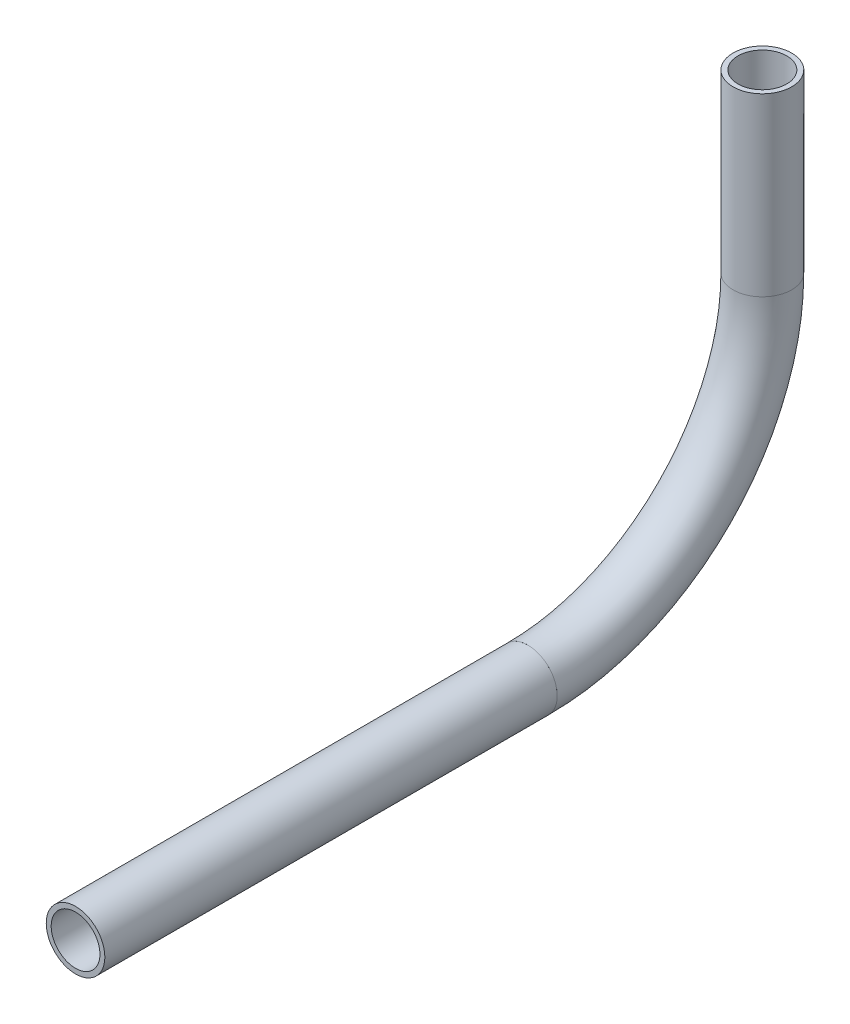
ISO-10303-21;
HEADER;
FILE_DESCRIPTION(('STEP AP214'),'2;1');
FILE_NAME('part.step','',(''),(''),'','','');
FILE_SCHEMA(('AUTOMOTIVE_DESIGN { 1 0 10303 214 1 1 1 1 }'));
ENDSEC;
DATA;
#1=APPLICATION_CONTEXT('core data for automotive mechanical design processes');
#2=APPLICATION_PROTOCOL_DEFINITION('international standard','automotive_design',2000,#1);
#3=PRODUCT_CONTEXT('',#1,'mechanical');
#4=PRODUCT('Part','Part','',(#3));
#5=PRODUCT_RELATED_PRODUCT_CATEGORY('part','',(#4));
#6=PRODUCT_DEFINITION_FORMATION('','',#4);
#7=PRODUCT_DEFINITION_CONTEXT('part definition',#1,'design');
#8=PRODUCT_DEFINITION('design','',#6,#7);
#9=PRODUCT_DEFINITION_SHAPE('','',#8);
#10=(LENGTH_UNIT() NAMED_UNIT(*) SI_UNIT(.MILLI.,.METRE.));
#11=(NAMED_UNIT(*) PLANE_ANGLE_UNIT() SI_UNIT($,.RADIAN.));
#12=(NAMED_UNIT(*) SI_UNIT($,.STERADIAN.) SOLID_ANGLE_UNIT());
#13=UNCERTAINTY_MEASURE_WITH_UNIT(LENGTH_MEASURE(1.E-05),#10,'distance_accuracy_value','');
#14=(GEOMETRIC_REPRESENTATION_CONTEXT(3) GLOBAL_UNCERTAINTY_ASSIGNED_CONTEXT((#13)) GLOBAL_UNIT_ASSIGNED_CONTEXT((#10,
#11,#12)) REPRESENTATION_CONTEXT('',''));
#15=CARTESIAN_POINT('',(0.,0.,0.));
#16=DIRECTION('',(0.,0.,1.));
#17=DIRECTION('',(1.,0.,0.));
#18=AXIS2_PLACEMENT_3D('',#15,#16,#17);
#19=CARTESIAN_POINT('',(0.,-280.749158878772,278.748163937751));
#20=DIRECTION('',(0.,1.,0.));
#21=DIRECTION('',(0.,0.,1.));
#22=AXIS2_PLACEMENT_3D('',#19,#20,#21);
#23=CYLINDRICAL_SURFACE('',#22,5.28319999999999);
#24=CARTESIAN_POINT('',(0.,-242.649158878772,278.748163937751));
#25=DIRECTION('',(0.,-1.,0.));
#26=DIRECTION('',(0.,0.,-1.));
#27=AXIS2_PLACEMENT_3D('',#24,#25,#26);
#28=CIRCLE('',#27,5.28319999999999);
#29=CARTESIAN_POINT('',(0.,-242.649158878772,273.464963937751));
#30=VERTEX_POINT('',#29);
#31=EDGE_CURVE('E55',#30,#30,#28,.T.);
#32=ORIENTED_EDGE('',*,*,#31,.F.);
#33=EDGE_LOOP('',(#32));
#34=FACE_BOUND('',#33,.T.);
#35=CARTESIAN_POINT('',(0.,-280.749158878772,278.748163937751));
#36=DIRECTION('',(0.,-1.,0.));
#37=DIRECTION('',(0.,0.,-1.));
#38=AXIS2_PLACEMENT_3D('',#35,#36,#37);
#39=CIRCLE('',#38,5.28319999999999);
#40=CARTESIAN_POINT('',(0.,-280.749158878772,273.464963937751));
#41=VERTEX_POINT('',#40);
#42=EDGE_CURVE('E51',#41,#41,#39,.T.);
#43=ORIENTED_EDGE('',*,*,#42,.T.);
#44=EDGE_LOOP('',(#43));
#45=FACE_BOUND('',#44,.T.);
#46=ADVANCED_FACE('F47',(#34,#45),#23,.F.);
#47=CARTESIAN_POINT('',(0.,-280.749158878772,278.748163937751));
#48=DIRECTION('',(0.,1.,0.));
#49=DIRECTION('',(0.,0.,1.));
#50=AXIS2_PLACEMENT_3D('',#47,#48,#49);
#51=CYLINDRICAL_SURFACE('',#50,6.35);
#52=CARTESIAN_POINT('',(0.,-242.649158878772,278.748163937751));
#53=DIRECTION('',(0.,-1.,0.));
#54=DIRECTION('',(0.,0.,-1.));
#55=AXIS2_PLACEMENT_3D('',#52,#53,#54);
#56=CIRCLE('',#55,6.35);
#57=CARTESIAN_POINT('',(0.,-242.649158878772,272.398163937751));
#58=VERTEX_POINT('',#57);
#59=EDGE_CURVE('E59',#58,#58,#56,.T.);
#60=ORIENTED_EDGE('',*,*,#59,.T.);
#61=EDGE_LOOP('',(#60));
#62=FACE_BOUND('',#61,.T.);
#63=CARTESIAN_POINT('',(0.,-280.749158878772,278.748163937751));
#64=DIRECTION('',(0.,-1.,0.));
#65=DIRECTION('',(0.,0.,-1.));
#66=AXIS2_PLACEMENT_3D('',#63,#64,#65);
#67=CIRCLE('',#66,6.35);
#68=CARTESIAN_POINT('',(0.,-280.749158878772,272.398163937751));
#69=VERTEX_POINT('',#68);
#70=EDGE_CURVE('E12',#69,#69,#67,.T.);
#71=ORIENTED_EDGE('',*,*,#70,.F.);
#72=EDGE_LOOP('',(#71));
#73=FACE_BOUND('',#72,.T.);
#74=ADVANCED_FACE('F74',(#62,#73),#51,.T.);
#75=CARTESIAN_POINT('',(0.,-242.649158878772,278.748163937751));
#76=DIRECTION('',(0.,-1.,0.));
#77=DIRECTION('',(0.,0.,-1.));
#78=AXIS2_PLACEMENT_3D('',#75,#76,#77);
#79=PLANE('',#78);
#80=ORIENTED_EDGE('',*,*,#31,.T.);
#81=EDGE_LOOP('',(#80));
#82=FACE_BOUND('',#81,.T.);
#83=ORIENTED_EDGE('',*,*,#59,.F.);
#84=EDGE_LOOP('',(#83));
#85=FACE_BOUND('',#84,.T.);
#86=ADVANCED_FACE('F70',(#82,#85),#79,.F.);
#87=CARTESIAN_POINT('',(0.,-280.749158878772,278.748163937751));
#88=DIRECTION('',(0.,-1.,0.));
#89=DIRECTION('',(0.,0.,-1.));
#90=AXIS2_PLACEMENT_3D('',#87,#88,#89);
#91=PLANE('',#90);
#92=ORIENTED_EDGE('',*,*,#42,.F.);
#93=EDGE_LOOP('',(#92));
#94=FACE_BOUND('',#93,.T.);
#95=ORIENTED_EDGE('',*,*,#70,.T.);
#96=EDGE_LOOP('',(#95));
#97=FACE_BOUND('',#96,.T.);
#98=ADVANCED_FACE('F49',(#94,#97),#91,.T.);
#99=CLOSED_SHELL('',(#46,#74,#86,#98));
#100=MANIFOLD_SOLID_BREP('B2',#99);
#101=CARTESIAN_POINT('',(0.,-280.749158878772,329.548163937751));
#102=DIRECTION('',(1.,0.,0.));
#103=DIRECTION('',(0.,0.,-1.));
#104=AXIS2_PLACEMENT_3D('',#101,#102,#103);
#105=TOROIDAL_SURFACE('',#104,50.8,5.28319999999999);
#106=CARTESIAN_POINT('',(0.,-331.549158878772,329.548163937751));
#107=DIRECTION('',(0.,0.,1.));
#108=DIRECTION('',(0.,-1.,0.));
#109=AXIS2_PLACEMENT_3D('',#106,#107,#108);
#110=CIRCLE('',#109,5.28319999999999);
#111=CARTESIAN_POINT('',(0.,-336.832358878772,329.548163937751));
#112=VERTEX_POINT('',#111);
#113=EDGE_CURVE('E150',#112,#112,#110,.T.);
#114=CARTESIAN_POINT('',(0.,-280.749158878772,278.748163937751));
#115=DIRECTION('',(0.,1.,0.));
#116=DIRECTION('',(0.,0.,1.));
#117=AXIS2_PLACEMENT_3D('',#114,#115,#116);
#118=CIRCLE('',#117,5.28319999999999);
#119=CARTESIAN_POINT('',(0.,-280.749158878772,273.464963937751));
#120=VERTEX_POINT('',#119);
#121=EDGE_CURVE('E140',#120,#120,#118,.T.);
#122=CARTESIAN_POINT('',(0.,-280.749158878772,329.548163937751));
#123=DIRECTION('',(1.,0.,0.));
#124=DIRECTION('',(0.,0.,-1.));
#125=AXIS2_PLACEMENT_3D('',#122,#123,#124);
#126=CIRCLE('',#125,56.0832);
#127=EDGE_CURVE('',#112,#120,#126,.T.);
#128=ORIENTED_EDGE('',*,*,#113,.T.);
#129=ORIENTED_EDGE('',*,*,#121,.T.);
#130=ORIENTED_EDGE('',*,*,#127,.T.);
#131=ORIENTED_EDGE('',*,*,#127,.F.);
#132=EDGE_LOOP('',(#128,#130,#129,#131));
#133=FACE_BOUND('',#132,.T.);
#134=ADVANCED_FACE('F136',(#133),#105,.F.);
#135=CARTESIAN_POINT('',(0.,-280.749158878772,329.548163937751));
#136=DIRECTION('',(1.,0.,0.));
#137=DIRECTION('',(0.,0.,-1.));
#138=AXIS2_PLACEMENT_3D('',#135,#136,#137);
#139=TOROIDAL_SURFACE('',#138,50.8,6.35);
#140=CARTESIAN_POINT('',(0.,-331.549158878772,329.548163937751));
#141=DIRECTION('',(0.,0.,1.));
#142=DIRECTION('',(0.,-1.,0.));
#143=AXIS2_PLACEMENT_3D('',#140,#141,#142);
#144=CIRCLE('',#143,6.35);
#145=CARTESIAN_POINT('',(0.,-337.899158878772,329.548163937751));
#146=VERTEX_POINT('',#145);
#147=EDGE_CURVE('E144',#146,#146,#144,.T.);
#148=CARTESIAN_POINT('',(0.,-280.749158878772,278.748163937751));
#149=DIRECTION('',(0.,1.,0.));
#150=DIRECTION('',(0.,0.,1.));
#151=AXIS2_PLACEMENT_3D('',#148,#149,#150);
#152=CIRCLE('',#151,6.35);
#153=CARTESIAN_POINT('',(0.,-280.749158878772,272.398163937751));
#154=VERTEX_POINT('',#153);
#155=EDGE_CURVE('E46',#154,#154,#152,.T.);
#156=CARTESIAN_POINT('',(0.,-280.749158878772,329.548163937751));
#157=DIRECTION('',(1.,0.,0.));
#158=DIRECTION('',(0.,0.,-1.));
#159=AXIS2_PLACEMENT_3D('',#156,#157,#158);
#160=CIRCLE('',#159,57.15);
#161=EDGE_CURVE('',#146,#154,#160,.T.);
#162=ORIENTED_EDGE('',*,*,#147,.F.);
#163=ORIENTED_EDGE('',*,*,#155,.F.);
#164=ORIENTED_EDGE('',*,*,#161,.T.);
#165=ORIENTED_EDGE('',*,*,#161,.F.);
#166=EDGE_LOOP('',(#162,#164,#163,#165));
#167=FACE_BOUND('',#166,.T.);
#168=ADVANCED_FACE('F163',(#167),#139,.T.);
#169=CARTESIAN_POINT('',(0.,-331.549158878772,329.548163937751));
#170=DIRECTION('',(0.,0.,1.));
#171=DIRECTION('',(0.,-1.,0.));
#172=AXIS2_PLACEMENT_3D('',#169,#170,#171);
#173=PLANE('',#172);
#174=ORIENTED_EDGE('',*,*,#113,.F.);
#175=EDGE_LOOP('',(#174));
#176=FACE_BOUND('',#175,.T.);
#177=ORIENTED_EDGE('',*,*,#147,.T.);
#178=EDGE_LOOP('',(#177));
#179=FACE_BOUND('',#178,.T.);
#180=ADVANCED_FACE('F159',(#176,#179),#173,.T.);
#181=CARTESIAN_POINT('',(0.,-280.749158878772,278.748163937751));
#182=DIRECTION('',(0.,1.,0.));
#183=DIRECTION('',(0.,0.,1.));
#184=AXIS2_PLACEMENT_3D('',#181,#182,#183);
#185=PLANE('',#184);
#186=ORIENTED_EDGE('',*,*,#121,.F.);
#187=EDGE_LOOP('',(#186));
#188=FACE_BOUND('',#187,.T.);
#189=ORIENTED_EDGE('',*,*,#155,.T.);
#190=EDGE_LOOP('',(#189));
#191=FACE_BOUND('',#190,.T.);
#192=ADVANCED_FACE('F138',(#188,#191),#185,.T.);
#193=CLOSED_SHELL('',(#134,#168,#180,#192));
#194=MANIFOLD_SOLID_BREP('B7',#193);
#195=CARTESIAN_POINT('',(0.,-331.549158878772,427.577500046141));
#196=DIRECTION('',(0.,0.,-1.));
#197=DIRECTION('',(-1.,0.,0.));
#198=AXIS2_PLACEMENT_3D('',#195,#196,#197);
#199=CYLINDRICAL_SURFACE('',#198,5.28319999999999);
#200=CARTESIAN_POINT('',(0.,-331.549158878772,427.577500046141));
#201=DIRECTION('',(0.,0.,1.));
#202=DIRECTION('',(0.,-1.,0.));
#203=AXIS2_PLACEMENT_3D('',#200,#201,#202);
#204=CIRCLE('',#203,5.28319999999999);
#205=CARTESIAN_POINT('',(0.,-336.832358878772,427.577500046141));
#206=VERTEX_POINT('',#205);
#207=EDGE_CURVE('E234',#206,#206,#204,.T.);
#208=ORIENTED_EDGE('',*,*,#207,.T.);
#209=EDGE_LOOP('',(#208));
#210=FACE_BOUND('',#209,.T.);
#211=CARTESIAN_POINT('',(0.,-331.549158878772,329.548163937751));
#212=DIRECTION('',(0.,0.,-1.));
#213=DIRECTION('',(0.,1.,0.));
#214=AXIS2_PLACEMENT_3D('',#211,#212,#213);
#215=CIRCLE('',#214,5.28319999999999);
#216=CARTESIAN_POINT('',(0.,-326.265958878772,329.548163937751));
#217=VERTEX_POINT('',#216);
#218=EDGE_CURVE('E224',#217,#217,#215,.T.);
#219=ORIENTED_EDGE('',*,*,#218,.T.);
#220=EDGE_LOOP('',(#219));
#221=FACE_BOUND('',#220,.T.);
#222=ADVANCED_FACE('F220',(#210,#221),#199,.F.);
#223=CARTESIAN_POINT('',(0.,-331.549158878772,427.577500046141));
#224=DIRECTION('',(0.,0.,-1.));
#225=DIRECTION('',(-1.,0.,0.));
#226=AXIS2_PLACEMENT_3D('',#223,#224,#225);
#227=CYLINDRICAL_SURFACE('',#226,6.35);
#228=CARTESIAN_POINT('',(0.,-331.549158878772,427.577500046141));
#229=DIRECTION('',(0.,0.,1.));
#230=DIRECTION('',(0.,-1.,0.));
#231=AXIS2_PLACEMENT_3D('',#228,#229,#230);
#232=CIRCLE('',#231,6.35);
#233=CARTESIAN_POINT('',(0.,-337.899158878772,427.577500046141));
#234=VERTEX_POINT('',#233);
#235=EDGE_CURVE('E228',#234,#234,#232,.T.);
#236=ORIENTED_EDGE('',*,*,#235,.F.);
#237=EDGE_LOOP('',(#236));
#238=FACE_BOUND('',#237,.T.);
#239=CARTESIAN_POINT('',(0.,-331.549158878772,329.548163937751));
#240=DIRECTION('',(0.,0.,-1.));
#241=DIRECTION('',(0.,1.,0.));
#242=AXIS2_PLACEMENT_3D('',#239,#240,#241);
#243=CIRCLE('',#242,6.35);
#244=CARTESIAN_POINT('',(0.,-325.199158878772,329.548163937751));
#245=VERTEX_POINT('',#244);
#246=EDGE_CURVE('E135',#245,#245,#243,.T.);
#247=ORIENTED_EDGE('',*,*,#246,.F.);
#248=EDGE_LOOP('',(#247));
#249=FACE_BOUND('',#248,.T.);
#250=ADVANCED_FACE('F247',(#238,#249),#227,.T.);
#251=CARTESIAN_POINT('',(0.,-331.549158878772,427.577500046141));
#252=DIRECTION('',(0.,0.,1.));
#253=DIRECTION('',(0.,-1.,0.));
#254=AXIS2_PLACEMENT_3D('',#251,#252,#253);
#255=PLANE('',#254);
#256=ORIENTED_EDGE('',*,*,#207,.F.);
#257=EDGE_LOOP('',(#256));
#258=FACE_BOUND('',#257,.T.);
#259=ORIENTED_EDGE('',*,*,#235,.T.);
#260=EDGE_LOOP('',(#259));
#261=FACE_BOUND('',#260,.T.);
#262=ADVANCED_FACE('F243',(#258,#261),#255,.T.);
#263=CARTESIAN_POINT('',(0.,-331.549158878772,329.548163937751));
#264=DIRECTION('',(0.,0.,-1.));
#265=DIRECTION('',(0.,1.,0.));
#266=AXIS2_PLACEMENT_3D('',#263,#264,#265);
#267=PLANE('',#266);
#268=ORIENTED_EDGE('',*,*,#218,.F.);
#269=EDGE_LOOP('',(#268));
#270=FACE_BOUND('',#269,.T.);
#271=ORIENTED_EDGE('',*,*,#246,.T.);
#272=EDGE_LOOP('',(#271));
#273=FACE_BOUND('',#272,.T.);
#274=ADVANCED_FACE('F222',(#270,#273),#267,.T.);
#275=CLOSED_SHELL('',(#222,#250,#262,#274));
#276=MANIFOLD_SOLID_BREP('B41',#275);
#277=ADVANCED_BREP_SHAPE_REPRESENTATION('',(#18,#100,#194,#276),#14);
#278=SHAPE_DEFINITION_REPRESENTATION(#9,#277);
ENDSEC;
END-ISO-10303-21;
